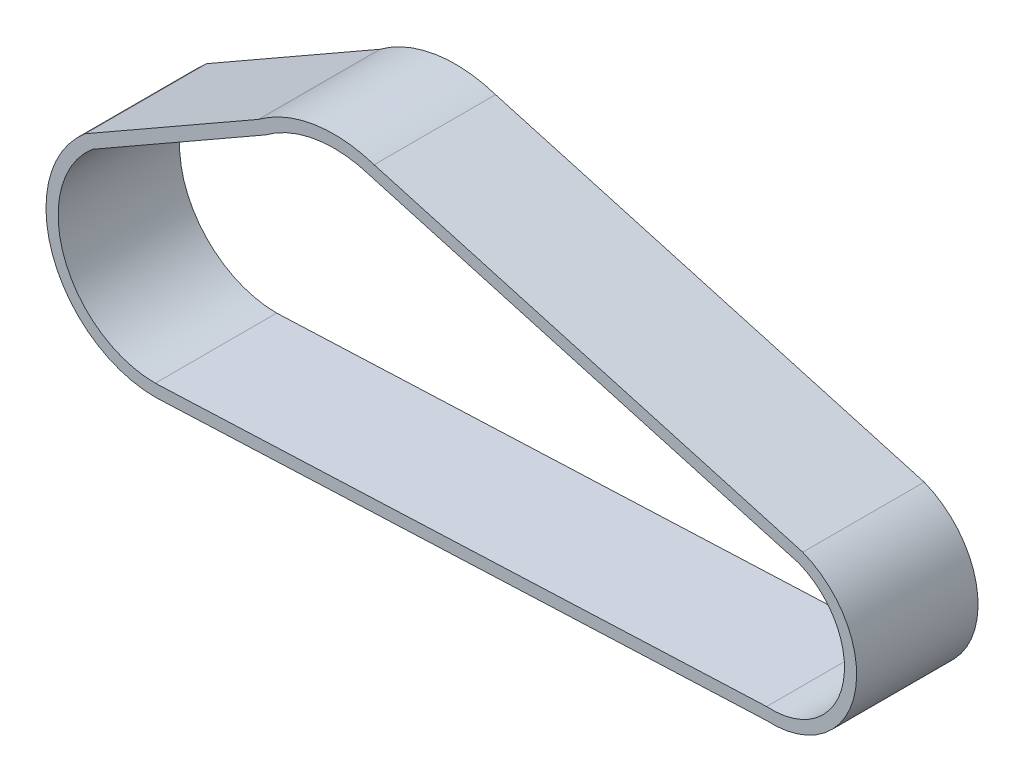
ISO-10303-21;
HEADER;
FILE_DESCRIPTION(('STEP AP214'),'2;1');
FILE_NAME('part.step','',(''),(''),'','','');
FILE_SCHEMA(('AUTOMOTIVE_DESIGN { 1 0 10303 214 1 1 1 1 }'));
ENDSEC;
DATA;
#1=APPLICATION_CONTEXT('core data for automotive mechanical design processes');
#2=APPLICATION_PROTOCOL_DEFINITION('international standard','automotive_design',2000,#1);
#3=PRODUCT_CONTEXT('',#1,'mechanical');
#4=PRODUCT('Part','Part','',(#3));
#5=PRODUCT_RELATED_PRODUCT_CATEGORY('part','',(#4));
#6=PRODUCT_DEFINITION_FORMATION('','',#4);
#7=PRODUCT_DEFINITION_CONTEXT('part definition',#1,'design');
#8=PRODUCT_DEFINITION('design','',#6,#7);
#9=PRODUCT_DEFINITION_SHAPE('','',#8);
#10=(LENGTH_UNIT() NAMED_UNIT(*) SI_UNIT(.MILLI.,.METRE.));
#11=(NAMED_UNIT(*) PLANE_ANGLE_UNIT() SI_UNIT($,.RADIAN.));
#12=(NAMED_UNIT(*) SI_UNIT($,.STERADIAN.) SOLID_ANGLE_UNIT());
#13=UNCERTAINTY_MEASURE_WITH_UNIT(LENGTH_MEASURE(1.E-05),#10,'distance_accuracy_value','');
#14=(GEOMETRIC_REPRESENTATION_CONTEXT(3) GLOBAL_UNCERTAINTY_ASSIGNED_CONTEXT((#13)) GLOBAL_UNIT_ASSIGNED_CONTEXT((#10,
#11,#12)) REPRESENTATION_CONTEXT('',''));
#15=CARTESIAN_POINT('',(0.,0.,0.));
#16=DIRECTION('',(0.,0.,1.));
#17=DIRECTION('',(1.,0.,0.));
#18=AXIS2_PLACEMENT_3D('',#15,#16,#17);
#19=CARTESIAN_POINT('',(14.0143768297431,-7.07290026338593,-23.25));
#20=DIRECTION('',(0.,0.,1.));
#21=DIRECTION('',(1.,0.,0.));
#22=AXIS2_PLACEMENT_3D('',#19,#20,#21);
#23=CYLINDRICAL_SURFACE('',#22,32.55);
#24=DIRECTION('',(0.,0.,1.));
#25=VECTOR('',#24,1.);
#26=CARTESIAN_POINT('',(25.9394469295499,23.213981436695,-23.25));
#27=LINE('',#26,#25);
#28=CARTESIAN_POINT('',(25.9394469295499,23.213981436695,-23.25));
#29=VERTEX_POINT('',#28);
#30=CARTESIAN_POINT('',(25.9394469295499,23.213981436695,23.25));
#31=VERTEX_POINT('',#30);
#32=EDGE_CURVE('E116',#29,#31,#27,.T.);
#33=ORIENTED_EDGE('',*,*,#32,.T.);
#34=CARTESIAN_POINT('',(14.0143768297431,-7.07290026338593,23.25));
#35=DIRECTION('',(0.,0.,1.));
#36=DIRECTION('',(1.,0.,0.));
#37=AXIS2_PLACEMENT_3D('',#34,#35,#36);
#38=CIRCLE('',#37,32.55);
#39=CARTESIAN_POINT('',(12.0476661732121,-39.5634304097761,23.25));
#40=VERTEX_POINT('',#39);
#41=EDGE_CURVE('E247',#40,#31,#38,.T.);
#42=ORIENTED_EDGE('',*,*,#41,.F.);
#43=DIRECTION('',(0.,0.,1.));
#44=VECTOR('',#43,1.);
#45=CARTESIAN_POINT('',(12.0476661732121,-39.5634304097761,-23.25));
#46=LINE('',#45,#44);
#47=CARTESIAN_POINT('',(12.0476661732121,-39.5634304097761,-23.25));
#48=VERTEX_POINT('',#47);
#49=EDGE_CURVE('E12',#48,#40,#46,.T.);
#50=ORIENTED_EDGE('',*,*,#49,.F.);
#51=CARTESIAN_POINT('',(14.0143768297431,-7.07290026338593,-23.25));
#52=DIRECTION('',(0.,0.,1.));
#53=DIRECTION('',(1.,0.,0.));
#54=AXIS2_PLACEMENT_3D('',#51,#52,#53);
#55=CIRCLE('',#54,32.55);
#56=EDGE_CURVE('E291',#48,#29,#55,.T.);
#57=ORIENTED_EDGE('',*,*,#56,.T.);
#58=EDGE_LOOP('',(#33,#42,#50,#57));
#59=FACE_BOUND('',#58,.T.);
#60=ADVANCED_FACE('F113',(#59),#23,.T.);
#61=CARTESIAN_POINT('',(-221.858988340068,-49.3790376982258,-23.25));
#62=DIRECTION('',(0.0419268800469785,-0.999120681764483,0.));
#63=DIRECTION('',(0.999120681764484,0.0419268800469785,0.));
#64=AXIS2_PLACEMENT_3D('',#61,#62,#63);
#65=PLANE('',#64);
#66=ORIENTED_EDGE('',*,*,#49,.T.);
#67=DIRECTION('',(0.999120681764484,0.0419268800469785,0.));
#68=VECTOR('',#67,1.);
#69=CARTESIAN_POINT('',(-221.858988340068,-49.3790376982258,23.25));
#70=LINE('',#69,#68);
#71=CARTESIAN_POINT('',(-221.953555988933,-49.3830061141966,23.25));
#72=VERTEX_POINT('',#71);
#73=EDGE_CURVE('E267',#72,#40,#70,.T.);
#74=ORIENTED_EDGE('',*,*,#73,.F.);
#75=DIRECTION('',(0.,0.,1.));
#76=VECTOR('',#75,1.);
#77=CARTESIAN_POINT('',(-221.953555988933,-49.3830061141966,-23.25));
#78=LINE('',#77,#76);
#79=CARTESIAN_POINT('',(-221.953555988933,-49.3830061141966,-23.25));
#80=VERTEX_POINT('',#79);
#81=EDGE_CURVE('E122',#80,#72,#78,.T.);
#82=ORIENTED_EDGE('',*,*,#81,.F.);
#83=DIRECTION('',(0.999120681764484,0.0419268800469785,0.));
#84=VECTOR('',#83,1.);
#85=CARTESIAN_POINT('',(-221.858988340068,-49.3790376982258,-23.25));
#86=LINE('',#85,#84);
#87=EDGE_CURVE('E321',#80,#48,#86,.T.);
#88=ORIENTED_EDGE('',*,*,#87,.T.);
#89=EDGE_LOOP('',(#66,#74,#82,#88));
#90=FACE_BOUND('',#89,.T.);
#91=ADVANCED_FACE('F344',(#90),#65,.T.);
#92=CARTESIAN_POINT('',(-222.053948332286,-7.53312652802096,-23.25));
#93=DIRECTION('',(0.,0.,1.));
#94=DIRECTION('',(1.,0.,0.));
#95=AXIS2_PLACEMENT_3D('',#92,#93,#94);
#96=CYLINDRICAL_SURFACE('',#95,41.85);
#97=ORIENTED_EDGE('',*,*,#81,.T.);
#98=CARTESIAN_POINT('',(-222.053948332286,-7.53312652802096,23.25));
#99=DIRECTION('',(0.,0.,1.));
#100=DIRECTION('',(1.,0.,0.));
#101=AXIS2_PLACEMENT_3D('',#98,#99,#100);
#102=CIRCLE('',#101,41.85);
#103=CARTESIAN_POINT('',(-248.86435478823,24.6013503724531,23.25));
#104=VERTEX_POINT('',#103);
#105=EDGE_CURVE('E263',#104,#72,#102,.T.);
#106=ORIENTED_EDGE('',*,*,#105,.F.);
#107=DIRECTION('',(0.,0.,1.));
#108=VECTOR('',#107,1.);
#109=CARTESIAN_POINT('',(-248.86435478823,24.6013503724531,-23.25));
#110=LINE('',#109,#108);
#111=CARTESIAN_POINT('',(-248.86435478823,24.6013503724531,-23.25));
#112=VERTEX_POINT('',#111);
#113=EDGE_CURVE('E327',#112,#104,#110,.T.);
#114=ORIENTED_EDGE('',*,*,#113,.F.);
#115=CARTESIAN_POINT('',(-222.053948332286,-7.53312652802096,-23.25));
#116=DIRECTION('',(0.,0.,1.));
#117=DIRECTION('',(1.,0.,0.));
#118=AXIS2_PLACEMENT_3D('',#115,#116,#117);
#119=CIRCLE('',#118,41.85);
#120=EDGE_CURVE('E317',#112,#80,#119,.T.);
#121=ORIENTED_EDGE('',*,*,#120,.T.);
#122=EDGE_LOOP('',(#97,#106,#114,#121));
#123=FACE_BOUND('',#122,.T.);
#124=ADVANCED_FACE('F357',(#123),#96,.T.);
#125=CARTESIAN_POINT('',(-182.250224594019,62.6910104216595,-23.25));
#126=DIRECTION('',(-0.4963790457982,0.86810589382429,0.));
#127=DIRECTION('',(-0.86810589382429,-0.4963790457982,0.));
#128=AXIS2_PLACEMENT_3D('',#125,#126,#127);
#129=PLANE('',#128);
#130=ORIENTED_EDGE('',*,*,#113,.T.);
#131=DIRECTION('',(-0.868105893824289,-0.4963790457982,0.));
#132=VECTOR('',#131,1.);
#133=CARTESIAN_POINT('',(-182.250224594019,62.6910104216595,23.25));
#134=LINE('',#133,#132);
#135=CARTESIAN_POINT('',(-182.494443037376,62.5513674141156,23.25));
#136=VERTEX_POINT('',#135);
#137=EDGE_CURVE('E259',#136,#104,#134,.T.);
#138=ORIENTED_EDGE('',*,*,#137,.F.);
#139=DIRECTION('',(0.,0.,1.));
#140=VECTOR('',#139,1.);
#141=CARTESIAN_POINT('',(-182.494443037376,62.5513674141156,-23.25));
#142=LINE('',#141,#140);
#143=CARTESIAN_POINT('',(-182.494443037376,62.5513674141156,-23.25));
#144=VERTEX_POINT('',#143);
#145=EDGE_CURVE('E330',#144,#136,#142,.T.);
#146=ORIENTED_EDGE('',*,*,#145,.F.);
#147=DIRECTION('',(-0.868105893824289,-0.4963790457982,0.));
#148=VECTOR('',#147,1.);
#149=CARTESIAN_POINT('',(-182.250224594019,62.6910104216595,-23.25));
#150=LINE('',#149,#148);
#151=EDGE_CURVE('E313',#144,#112,#150,.T.);
#152=ORIENTED_EDGE('',*,*,#151,.T.);
#153=EDGE_LOOP('',(#130,#138,#146,#152));
#154=FACE_BOUND('',#153,.T.);
#155=ADVANCED_FACE('F355',(#154),#129,.T.);
#156=CARTESIAN_POINT('',(-153.533438865194,23.4346540979445,-23.25));
#157=DIRECTION('',(0.,0.,1.));
#158=DIRECTION('',(1.,0.,0.));
#159=AXIS2_PLACEMENT_3D('',#156,#157,#158);
#160=CYLINDRICAL_SURFACE('',#159,48.6709053061545);
#161=ORIENTED_EDGE('',*,*,#145,.T.);
#162=CARTESIAN_POINT('',(-153.533438865194,23.4346540979445,23.25));
#163=DIRECTION('',(0.,0.,1.));
#164=DIRECTION('',(1.,0.,0.));
#165=AXIS2_PLACEMENT_3D('',#162,#163,#164);
#166=CIRCLE('',#165,48.6709053061545);
#167=CARTESIAN_POINT('',(-138.21051198592,69.6305947764615,23.25));
#168=VERTEX_POINT('',#167);
#169=EDGE_CURVE('E255',#168,#136,#166,.T.);
#170=ORIENTED_EDGE('',*,*,#169,.F.);
#171=DIRECTION('',(0.,0.,1.));
#172=VECTOR('',#171,1.);
#173=CARTESIAN_POINT('',(-138.21051198592,69.6305947764615,-23.25));
#174=LINE('',#173,#172);
#175=CARTESIAN_POINT('',(-138.21051198592,69.6305947764615,-23.25));
#176=VERTEX_POINT('',#175);
#177=EDGE_CURVE('E332',#176,#168,#174,.T.);
#178=ORIENTED_EDGE('',*,*,#177,.F.);
#179=CARTESIAN_POINT('',(-153.533438865194,23.4346540979445,-23.25));
#180=DIRECTION('',(0.,0.,1.));
#181=DIRECTION('',(1.,0.,0.));
#182=AXIS2_PLACEMENT_3D('',#179,#180,#181);
#183=CIRCLE('',#182,48.6709053061545);
#184=EDGE_CURVE('E309',#176,#144,#183,.T.);
#185=ORIENTED_EDGE('',*,*,#184,.T.);
#186=EDGE_LOOP('',(#161,#170,#178,#185));
#187=FACE_BOUND('',#186,.T.);
#188=ADVANCED_FACE('F352',(#187),#160,.T.);
#189=CARTESIAN_POINT('',(25.70800144836,23.2794271759483,-23.25));
#190=DIRECTION('',(0.272100357386469,0.962268879009477,0.));
#191=DIRECTION('',(-0.962268879009477,0.27210035738647,0.));
#192=AXIS2_PLACEMENT_3D('',#189,#190,#191);
#193=PLANE('',#192);
#194=ORIENTED_EDGE('',*,*,#177,.T.);
#195=DIRECTION('',(-0.962268879009477,0.27210035738647,0.));
#196=VECTOR('',#195,1.);
#197=CARTESIAN_POINT('',(25.70800144836,23.2794271759483,23.25));
#198=LINE('',#197,#196);
#199=EDGE_CURVE('E251',#31,#168,#198,.T.);
#200=ORIENTED_EDGE('',*,*,#199,.F.);
#201=ORIENTED_EDGE('',*,*,#32,.F.);
#202=DIRECTION('',(-0.962268879009477,0.27210035738647,0.));
#203=VECTOR('',#202,1.);
#204=CARTESIAN_POINT('',(25.70800144836,23.2794271759483,-23.25));
#205=LINE('',#204,#203);
#206=EDGE_CURVE('E305',#29,#176,#205,.T.);
#207=ORIENTED_EDGE('',*,*,#206,.T.);
#208=EDGE_LOOP('',(#194,#200,#201,#207));
#209=FACE_BOUND('',#208,.T.);
#210=ADVANCED_FACE('F338',(#209),#193,.T.);
#211=CARTESIAN_POINT('',(14.0143768297431,-7.07290026338593,-23.25));
#212=DIRECTION('',(0.,0.,1.));
#213=DIRECTION('',(1.,0.,0.));
#214=AXIS2_PLACEMENT_3D('',#211,#212,#213);
#215=PLANE('',#214);
#216=DIRECTION('',(0.999120681764483,0.0419268800469785,0.));
#217=VECTOR('',#216,1.);
#218=CARTESIAN_POINT('',(-222.053948332286,-44.733126528021,-23.25));
#219=LINE('',#218,#217);
#220=CARTESIAN_POINT('',(-222.053948332286,-44.733126528021,-23.25));
#221=VERTEX_POINT('',#220);
#222=CARTESIAN_POINT('',(12.099974646038,-34.9071429202111,-23.25));
#223=VERTEX_POINT('',#222);
#224=EDGE_CURVE('E216',#221,#223,#219,.T.);
#225=ORIENTED_EDGE('',*,*,#224,.T.);
#226=CARTESIAN_POINT('',(14.0143768297431,-7.07290026338593,-23.25));
#227=DIRECTION('',(0.,0.,1.));
#228=DIRECTION('',(1.,0.,0.));
#229=AXIS2_PLACEMENT_3D('',#226,#227,#228);
#230=CIRCLE('',#229,27.9);
#231=CARTESIAN_POINT('',(24.4427347865129,18.8048768885542,-23.25));
#232=VERTEX_POINT('',#231);
#233=EDGE_CURVE('E271',#223,#232,#230,.T.);
#234=ORIENTED_EDGE('',*,*,#233,.T.);
#235=DIRECTION('',(-0.962268879009477,0.27210035738647,0.));
#236=VECTOR('',#235,1.);
#237=CARTESIAN_POINT('',(24.4427347865129,18.8048768885542,-23.25));
#238=LINE('',#237,#236);
#239=CARTESIAN_POINT('',(-139.578312280051,65.185037880205,-23.25));
#240=VERTEX_POINT('',#239);
#241=EDGE_CURVE('E210',#232,#240,#238,.T.);
#242=ORIENTED_EDGE('',*,*,#241,.T.);
#243=CARTESIAN_POINT('',(-153.533438865194,23.4346540979445,-23.25));
#244=DIRECTION('',(0.,0.,1.));
#245=DIRECTION('',(1.,0.,0.));
#246=AXIS2_PLACEMENT_3D('',#243,#244,#245);
#247=CIRCLE('',#246,44.0209053061545);
#248=CARTESIAN_POINT('',(-179.942062031057,58.6543180153766,-23.25));
#249=VERTEX_POINT('',#248);
#250=EDGE_CURVE('E130',#240,#249,#247,.T.);
#251=ORIENTED_EDGE('',*,*,#250,.T.);
#252=DIRECTION('',(-0.868105893824289,-0.4963790457982,0.));
#253=VECTOR('',#252,1.);
#254=CARTESIAN_POINT('',(-179.942062031057,58.6543180153766,-23.25));
#255=LINE('',#254,#253);
#256=CARTESIAN_POINT('',(-246.189688555335,20.7742231162947,-23.25));
#257=VERTEX_POINT('',#256);
#258=EDGE_CURVE('E278',#249,#257,#255,.T.);
#259=ORIENTED_EDGE('',*,*,#258,.T.);
#260=CARTESIAN_POINT('',(-222.053948332286,-7.53312652802096,-23.25));
#261=DIRECTION('',(0.,0.,1.));
#262=DIRECTION('',(1.,0.,0.));
#263=AXIS2_PLACEMENT_3D('',#260,#261,#262);
#264=CIRCLE('',#263,37.2);
#265=EDGE_CURVE('E282',#257,#221,#264,.T.);
#266=ORIENTED_EDGE('',*,*,#265,.T.);
#267=EDGE_LOOP('',(#225,#234,#242,#251,#259,#266));
#268=FACE_BOUND('',#267,.T.);
#269=ORIENTED_EDGE('',*,*,#56,.F.);
#270=ORIENTED_EDGE('',*,*,#87,.F.);
#271=ORIENTED_EDGE('',*,*,#120,.F.);
#272=ORIENTED_EDGE('',*,*,#151,.F.);
#273=ORIENTED_EDGE('',*,*,#184,.F.);
#274=ORIENTED_EDGE('',*,*,#206,.F.);
#275=EDGE_LOOP('',(#269,#270,#271,#272,#273,#274));
#276=FACE_BOUND('',#275,.T.);
#277=ADVANCED_FACE('F348',(#268,#276),#215,.F.);
#278=CARTESIAN_POINT('',(14.0143768297431,-7.07290026338593,-23.25));
#279=DIRECTION('',(0.,0.,1.));
#280=DIRECTION('',(1.,0.,0.));
#281=AXIS2_PLACEMENT_3D('',#278,#279,#280);
#282=CYLINDRICAL_SURFACE('',#281,27.9);
#283=DIRECTION('',(0.,0.,1.));
#284=VECTOR('',#283,1.);
#285=CARTESIAN_POINT('',(12.099974646038,-34.9071429202111,-23.25));
#286=LINE('',#285,#284);
#287=CARTESIAN_POINT('',(12.099974646038,-34.9071429202111,23.25));
#288=VERTEX_POINT('',#287);
#289=EDGE_CURVE('E221',#223,#288,#286,.T.);
#290=ORIENTED_EDGE('',*,*,#289,.T.);
#291=CARTESIAN_POINT('',(14.0143768297431,-7.07290026338593,23.25));
#292=DIRECTION('',(0.,0.,1.));
#293=DIRECTION('',(1.,0.,0.));
#294=AXIS2_PLACEMENT_3D('',#291,#292,#293);
#295=CIRCLE('',#294,27.9);
#296=CARTESIAN_POINT('',(24.4427347865129,18.8048768885542,23.25));
#297=VERTEX_POINT('',#296);
#298=EDGE_CURVE('E219',#288,#297,#295,.T.);
#299=ORIENTED_EDGE('',*,*,#298,.T.);
#300=DIRECTION('',(0.,0.,1.));
#301=VECTOR('',#300,1.);
#302=CARTESIAN_POINT('',(24.4427347865129,18.8048768885542,-23.25));
#303=LINE('',#302,#301);
#304=EDGE_CURVE('E203',#232,#297,#303,.T.);
#305=ORIENTED_EDGE('',*,*,#304,.F.);
#306=ORIENTED_EDGE('',*,*,#233,.F.);
#307=EDGE_LOOP('',(#290,#299,#305,#306));
#308=FACE_BOUND('',#307,.T.);
#309=ADVANCED_FACE('F220',(#308),#282,.F.);
#310=CARTESIAN_POINT('',(-222.053948332286,-44.733126528021,-23.25));
#311=DIRECTION('',(0.0419268800469785,-0.999120681764484,0.));
#312=DIRECTION('',(0.999120681764484,0.0419268800469785,0.));
#313=AXIS2_PLACEMENT_3D('',#310,#311,#312);
#314=PLANE('',#313);
#315=DIRECTION('',(0.,0.,1.));
#316=VECTOR('',#315,1.);
#317=CARTESIAN_POINT('',(-222.053948332286,-44.733126528021,-23.25));
#318=LINE('',#317,#316);
#319=CARTESIAN_POINT('',(-222.053948332286,-44.733126528021,23.25));
#320=VERTEX_POINT('',#319);
#321=EDGE_CURVE('E292',#221,#320,#318,.T.);
#322=ORIENTED_EDGE('',*,*,#321,.T.);
#323=DIRECTION('',(0.999120681764483,0.0419268800469785,0.));
#324=VECTOR('',#323,1.);
#325=CARTESIAN_POINT('',(-222.053948332286,-44.733126528021,23.25));
#326=LINE('',#325,#324);
#327=EDGE_CURVE('E244',#320,#288,#326,.T.);
#328=ORIENTED_EDGE('',*,*,#327,.T.);
#329=ORIENTED_EDGE('',*,*,#289,.F.);
#330=ORIENTED_EDGE('',*,*,#224,.F.);
#331=EDGE_LOOP('',(#322,#328,#329,#330));
#332=FACE_BOUND('',#331,.T.);
#333=ADVANCED_FACE('F416',(#332),#314,.F.);
#334=CARTESIAN_POINT('',(-222.053948332286,-7.53312652802096,-23.25));
#335=DIRECTION('',(0.,0.,1.));
#336=DIRECTION('',(1.,0.,0.));
#337=AXIS2_PLACEMENT_3D('',#334,#335,#336);
#338=CYLINDRICAL_SURFACE('',#337,37.2);
#339=DIRECTION('',(0.,0.,1.));
#340=VECTOR('',#339,1.);
#341=CARTESIAN_POINT('',(-246.189688555335,20.7742231162947,-23.25));
#342=LINE('',#341,#340);
#343=CARTESIAN_POINT('',(-246.189688555335,20.7742231162947,23.25));
#344=VERTEX_POINT('',#343);
#345=EDGE_CURVE('E295',#257,#344,#342,.T.);
#346=ORIENTED_EDGE('',*,*,#345,.T.);
#347=CARTESIAN_POINT('',(-222.053948332286,-7.53312652802096,23.25));
#348=DIRECTION('',(0.,0.,1.));
#349=DIRECTION('',(1.,0.,0.));
#350=AXIS2_PLACEMENT_3D('',#347,#348,#349);
#351=CIRCLE('',#350,37.2);
#352=EDGE_CURVE('E240',#344,#320,#351,.T.);
#353=ORIENTED_EDGE('',*,*,#352,.T.);
#354=ORIENTED_EDGE('',*,*,#321,.F.);
#355=ORIENTED_EDGE('',*,*,#265,.F.);
#356=EDGE_LOOP('',(#346,#353,#354,#355));
#357=FACE_BOUND('',#356,.T.);
#358=ADVANCED_FACE('F425',(#357),#338,.F.);
#359=CARTESIAN_POINT('',(-179.942062031057,58.6543180153766,-23.25));
#360=DIRECTION('',(-0.4963790457982,0.86810589382429,0.));
#361=DIRECTION('',(-0.86810589382429,-0.4963790457982,0.));
#362=AXIS2_PLACEMENT_3D('',#359,#360,#361);
#363=PLANE('',#362);
#364=DIRECTION('',(0.,0.,1.));
#365=VECTOR('',#364,1.);
#366=CARTESIAN_POINT('',(-179.942062031057,58.6543180153766,-23.25));
#367=LINE('',#366,#365);
#368=CARTESIAN_POINT('',(-179.942062031057,58.6543180153766,23.25));
#369=VERTEX_POINT('',#368);
#370=EDGE_CURVE('E298',#249,#369,#367,.T.);
#371=ORIENTED_EDGE('',*,*,#370,.T.);
#372=DIRECTION('',(-0.868105893824289,-0.4963790457982,0.));
#373=VECTOR('',#372,1.);
#374=CARTESIAN_POINT('',(-179.942062031057,58.6543180153766,23.25));
#375=LINE('',#374,#373);
#376=EDGE_CURVE('E234',#369,#344,#375,.T.);
#377=ORIENTED_EDGE('',*,*,#376,.T.);
#378=ORIENTED_EDGE('',*,*,#345,.F.);
#379=ORIENTED_EDGE('',*,*,#258,.F.);
#380=EDGE_LOOP('',(#371,#377,#378,#379));
#381=FACE_BOUND('',#380,.T.);
#382=ADVANCED_FACE('F435',(#381),#363,.F.);
#383=CARTESIAN_POINT('',(-153.533438865194,23.4346540979445,-23.25));
#384=DIRECTION('',(0.,0.,1.));
#385=DIRECTION('',(1.,0.,0.));
#386=AXIS2_PLACEMENT_3D('',#383,#384,#385);
#387=CYLINDRICAL_SURFACE('',#386,44.0209053061545);
#388=DIRECTION('',(0.,0.,1.));
#389=VECTOR('',#388,1.);
#390=CARTESIAN_POINT('',(-139.578312280051,65.185037880205,-23.25));
#391=LINE('',#390,#389);
#392=CARTESIAN_POINT('',(-139.578312280051,65.185037880205,23.25));
#393=VERTEX_POINT('',#392);
#394=EDGE_CURVE('E215',#240,#393,#391,.T.);
#395=ORIENTED_EDGE('',*,*,#394,.T.);
#396=CARTESIAN_POINT('',(-153.533438865194,23.4346540979445,23.25));
#397=DIRECTION('',(0.,0.,1.));
#398=DIRECTION('',(1.,0.,0.));
#399=AXIS2_PLACEMENT_3D('',#396,#397,#398);
#400=CIRCLE('',#399,44.0209053061545);
#401=EDGE_CURVE('E230',#393,#369,#400,.T.);
#402=ORIENTED_EDGE('',*,*,#401,.T.);
#403=ORIENTED_EDGE('',*,*,#370,.F.);
#404=ORIENTED_EDGE('',*,*,#250,.F.);
#405=EDGE_LOOP('',(#395,#402,#403,#404));
#406=FACE_BOUND('',#405,.T.);
#407=ADVANCED_FACE('F445',(#406),#387,.F.);
#408=CARTESIAN_POINT('',(24.4427347865129,18.8048768885542,-23.25));
#409=DIRECTION('',(0.27210035738647,0.962268879009477,0.));
#410=DIRECTION('',(-0.962268879009477,0.27210035738647,0.));
#411=AXIS2_PLACEMENT_3D('',#408,#409,#410);
#412=PLANE('',#411);
#413=ORIENTED_EDGE('',*,*,#304,.T.);
#414=DIRECTION('',(-0.962268879009477,0.27210035738647,0.));
#415=VECTOR('',#414,1.);
#416=CARTESIAN_POINT('',(24.4427347865129,18.8048768885542,23.25));
#417=LINE('',#416,#415);
#418=EDGE_CURVE('E207',#297,#393,#417,.T.);
#419=ORIENTED_EDGE('',*,*,#418,.T.);
#420=ORIENTED_EDGE('',*,*,#394,.F.);
#421=ORIENTED_EDGE('',*,*,#241,.F.);
#422=EDGE_LOOP('',(#413,#419,#420,#421));
#423=FACE_BOUND('',#422,.T.);
#424=ADVANCED_FACE('F205',(#423),#412,.F.);
#425=CARTESIAN_POINT('',(14.0143768297431,-7.07290026338593,23.25));
#426=DIRECTION('',(0.,0.,1.));
#427=DIRECTION('',(1.,0.,0.));
#428=AXIS2_PLACEMENT_3D('',#425,#426,#427);
#429=PLANE('',#428);
#430=ORIENTED_EDGE('',*,*,#41,.T.);
#431=ORIENTED_EDGE('',*,*,#199,.T.);
#432=ORIENTED_EDGE('',*,*,#169,.T.);
#433=ORIENTED_EDGE('',*,*,#137,.T.);
#434=ORIENTED_EDGE('',*,*,#105,.T.);
#435=ORIENTED_EDGE('',*,*,#73,.T.);
#436=EDGE_LOOP('',(#430,#431,#432,#433,#434,#435));
#437=FACE_BOUND('',#436,.T.);
#438=ORIENTED_EDGE('',*,*,#418,.F.);
#439=ORIENTED_EDGE('',*,*,#298,.F.);
#440=ORIENTED_EDGE('',*,*,#327,.F.);
#441=ORIENTED_EDGE('',*,*,#352,.F.);
#442=ORIENTED_EDGE('',*,*,#376,.F.);
#443=ORIENTED_EDGE('',*,*,#401,.F.);
#444=EDGE_LOOP('',(#438,#439,#440,#441,#442,#443));
#445=FACE_BOUND('',#444,.T.);
#446=ADVANCED_FACE('F227',(#437,#445),#429,.T.);
#447=CLOSED_SHELL('',(#60,#91,#124,#155,#188,#210,#277,#309,#333,#358,#382,#407,#424,#446));
#448=MANIFOLD_SOLID_BREP('B2',#447);
#449=ADVANCED_BREP_SHAPE_REPRESENTATION('',(#18,#448),#14);
#450=SHAPE_DEFINITION_REPRESENTATION(#9,#449);
ENDSEC;
END-ISO-10303-21;
